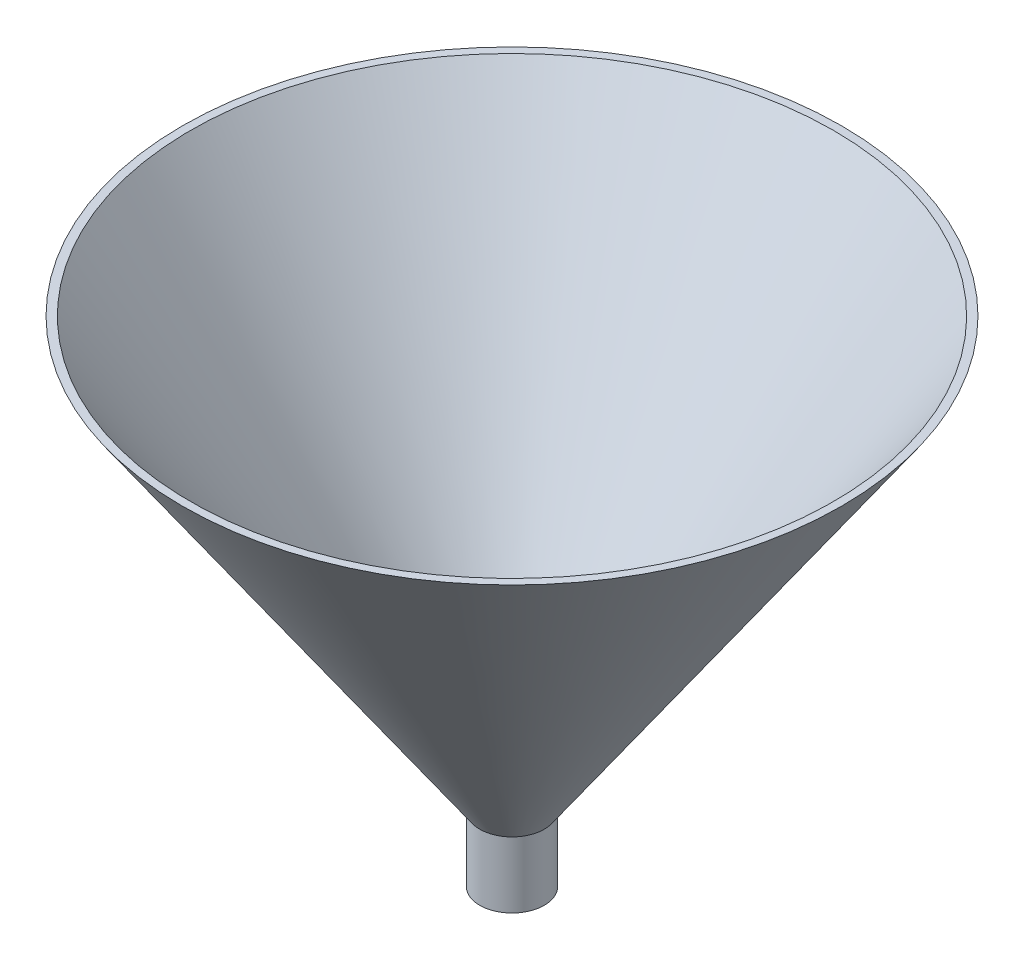
ISO-10303-21;
HEADER;
FILE_DESCRIPTION(('STEP AP214'),'2;1');
FILE_NAME('part.step','',(''),(''),'','','');
FILE_SCHEMA(('AUTOMOTIVE_DESIGN { 1 0 10303 214 1 1 1 1 }'));
ENDSEC;
DATA;
#1=APPLICATION_CONTEXT('core data for automotive mechanical design processes');
#2=APPLICATION_PROTOCOL_DEFINITION('international standard','automotive_design',2000,#1);
#3=PRODUCT_CONTEXT('',#1,'mechanical');
#4=PRODUCT('Part','Part','',(#3));
#5=PRODUCT_RELATED_PRODUCT_CATEGORY('part','',(#4));
#6=PRODUCT_DEFINITION_FORMATION('','',#4);
#7=PRODUCT_DEFINITION_CONTEXT('part definition',#1,'design');
#8=PRODUCT_DEFINITION('design','',#6,#7);
#9=PRODUCT_DEFINITION_SHAPE('','',#8);
#10=(LENGTH_UNIT() NAMED_UNIT(*) SI_UNIT(.MILLI.,.METRE.));
#11=(NAMED_UNIT(*) PLANE_ANGLE_UNIT() SI_UNIT($,.RADIAN.));
#12=(NAMED_UNIT(*) SI_UNIT($,.STERADIAN.) SOLID_ANGLE_UNIT());
#13=UNCERTAINTY_MEASURE_WITH_UNIT(LENGTH_MEASURE(1.E-05),#10,'distance_accuracy_value','');
#14=(GEOMETRIC_REPRESENTATION_CONTEXT(3) GLOBAL_UNCERTAINTY_ASSIGNED_CONTEXT((#13)) GLOBAL_UNIT_ASSIGNED_CONTEXT((#10,
#11,#12)) REPRESENTATION_CONTEXT('',''));
#15=CARTESIAN_POINT('',(0.,0.,0.));
#16=DIRECTION('',(0.,0.,1.));
#17=DIRECTION('',(1.,0.,0.));
#18=AXIS2_PLACEMENT_3D('',#15,#16,#17);
#19=CARTESIAN_POINT('',(0.,10.,0.));
#20=DIRECTION('',(0.,1.,0.));
#21=DIRECTION('',(0.,0.,1.));
#22=AXIS2_PLACEMENT_3D('',#19,#20,#21);
#23=CONICAL_SURFACE('',#22,4.9,0.606583914969572);
#24=CARTESIAN_POINT('',(0.,75.,0.));
#25=DIRECTION('',(0.,-1.,0.));
#26=DIRECTION('',(0.,0.,-1.));
#27=AXIS2_PLACEMENT_3D('',#24,#25,#26);
#28=CIRCLE('',#27,50.);
#29=CARTESIAN_POINT('',(0.,75.,-50.));
#30=VERTEX_POINT('',#29);
#31=EDGE_CURVE('E66',#30,#30,#28,.T.);
#32=ORIENTED_EDGE('',*,*,#31,.T.);
#33=EDGE_LOOP('',(#32));
#34=FACE_BOUND('',#33,.T.);
#35=CARTESIAN_POINT('',(0.,10.,0.));
#36=DIRECTION('',(0.,-1.,0.));
#37=DIRECTION('',(0.,0.,-1.));
#38=AXIS2_PLACEMENT_3D('',#35,#36,#37);
#39=CIRCLE('',#38,4.9);
#40=CARTESIAN_POINT('',(0.,10.,-4.9));
#41=VERTEX_POINT('',#40);
#42=EDGE_CURVE('E10',#41,#41,#39,.T.);
#43=ORIENTED_EDGE('',*,*,#42,.F.);
#44=EDGE_LOOP('',(#43));
#45=FACE_BOUND('',#44,.T.);
#46=ADVANCED_FACE('F43',(#34,#45),#23,.T.);
#47=CARTESIAN_POINT('',(0.,0.,0.));
#48=DIRECTION('',(0.,-1.,0.));
#49=DIRECTION('',(0.,0.,-1.));
#50=AXIS2_PLACEMENT_3D('',#47,#48,#49);
#51=CYLINDRICAL_SURFACE('',#50,4.9);
#52=ORIENTED_EDGE('',*,*,#42,.T.);
#53=EDGE_LOOP('',(#52));
#54=FACE_BOUND('',#53,.T.);
#55=CARTESIAN_POINT('',(0.,0.,0.));
#56=DIRECTION('',(0.,-1.,0.));
#57=DIRECTION('',(0.,0.,-1.));
#58=AXIS2_PLACEMENT_3D('',#55,#56,#57);
#59=CIRCLE('',#58,4.9);
#60=CARTESIAN_POINT('',(0.,0.,-4.9));
#61=VERTEX_POINT('',#60);
#62=EDGE_CURVE('E50',#61,#61,#59,.T.);
#63=ORIENTED_EDGE('',*,*,#62,.F.);
#64=EDGE_LOOP('',(#63));
#65=FACE_BOUND('',#64,.T.);
#66=ADVANCED_FACE('F89',(#54,#65),#51,.T.);
#67=CARTESIAN_POINT('',(0.,0.,-4.9));
#68=DIRECTION('',(0.,1.,0.));
#69=DIRECTION('',(0.,0.,1.));
#70=AXIS2_PLACEMENT_3D('',#67,#68,#69);
#71=PLANE('',#70);
#72=CARTESIAN_POINT('',(0.,0.,0.));
#73=DIRECTION('',(0.,-1.,0.));
#74=DIRECTION('',(0.,0.,-1.));
#75=AXIS2_PLACEMENT_3D('',#72,#73,#74);
#76=CIRCLE('',#75,3.9);
#77=CARTESIAN_POINT('',(0.,0.,-3.9));
#78=VERTEX_POINT('',#77);
#79=EDGE_CURVE('E55',#78,#78,#76,.T.);
#80=ORIENTED_EDGE('',*,*,#79,.F.);
#81=EDGE_LOOP('',(#80));
#82=FACE_BOUND('',#81,.T.);
#83=ORIENTED_EDGE('',*,*,#62,.T.);
#84=EDGE_LOOP('',(#83));
#85=FACE_BOUND('',#84,.T.);
#86=ADVANCED_FACE('F95',(#82,#85),#71,.F.);
#87=CARTESIAN_POINT('',(0.,0.,0.));
#88=DIRECTION('',(0.,-1.,0.));
#89=DIRECTION('',(0.,0.,-1.));
#90=AXIS2_PLACEMENT_3D('',#87,#88,#89);
#91=CYLINDRICAL_SURFACE('',#90,3.9);
#92=CARTESIAN_POINT('',(0.,10.312946900783,0.));
#93=DIRECTION('',(0.,-1.,0.));
#94=DIRECTION('',(0.,0.,-1.));
#95=AXIS2_PLACEMENT_3D('',#92,#93,#94);
#96=CIRCLE('',#95,3.9);
#97=CARTESIAN_POINT('',(0.,10.312946900783,-3.9));
#98=VERTEX_POINT('',#97);
#99=EDGE_CURVE('E60',#98,#98,#96,.T.);
#100=ORIENTED_EDGE('',*,*,#99,.F.);
#101=EDGE_LOOP('',(#100));
#102=FACE_BOUND('',#101,.T.);
#103=ORIENTED_EDGE('',*,*,#79,.T.);
#104=EDGE_LOOP('',(#103));
#105=FACE_BOUND('',#104,.T.);
#106=ADVANCED_FACE('F85',(#102,#105),#91,.F.);
#107=CARTESIAN_POINT('',(0.,10.312946900783,0.));
#108=DIRECTION('',(0.,1.,0.));
#109=DIRECTION('',(0.,0.,1.));
#110=AXIS2_PLACEMENT_3D('',#107,#108,#109);
#111=CONICAL_SURFACE('',#110,3.9,0.606583914969572);
#112=CARTESIAN_POINT('',(0.,75.,0.));
#113=DIRECTION('',(0.,-1.,0.));
#114=DIRECTION('',(0.,0.,-1.));
#115=AXIS2_PLACEMENT_3D('',#112,#113,#114);
#116=CIRCLE('',#115,48.7828629965336);
#117=CARTESIAN_POINT('',(0.,75.,-48.7828629965336));
#118=VERTEX_POINT('',#117);
#119=EDGE_CURVE('E70',#118,#118,#116,.F.);
#120=ORIENTED_EDGE('',*,*,#119,.T.);
#121=EDGE_LOOP('',(#120));
#122=FACE_BOUND('',#121,.T.);
#123=ORIENTED_EDGE('',*,*,#99,.T.);
#124=EDGE_LOOP('',(#123));
#125=FACE_BOUND('',#124,.T.);
#126=ADVANCED_FACE('F75',(#122,#125),#111,.F.);
#127=CARTESIAN_POINT('',(-50.,75.,50.));
#128=DIRECTION('',(0.,-1.,0.));
#129=DIRECTION('',(0.,0.,-1.));
#130=AXIS2_PLACEMENT_3D('',#127,#128,#129);
#131=PLANE('',#130);
#132=ORIENTED_EDGE('',*,*,#31,.F.);
#133=EDGE_LOOP('',(#132));
#134=FACE_BOUND('',#133,.T.);
#135=ORIENTED_EDGE('',*,*,#119,.F.);
#136=EDGE_LOOP('',(#135));
#137=FACE_BOUND('',#136,.T.);
#138=ADVANCED_FACE('F78',(#134,#137),#131,.F.);
#139=CLOSED_SHELL('',(#46,#66,#86,#106,#126,#138));
#140=MANIFOLD_SOLID_BREP('B2',#139);
#141=ADVANCED_BREP_SHAPE_REPRESENTATION('',(#18,#140),#14);
#142=SHAPE_DEFINITION_REPRESENTATION(#9,#141);
ENDSEC;
END-ISO-10303-21;
